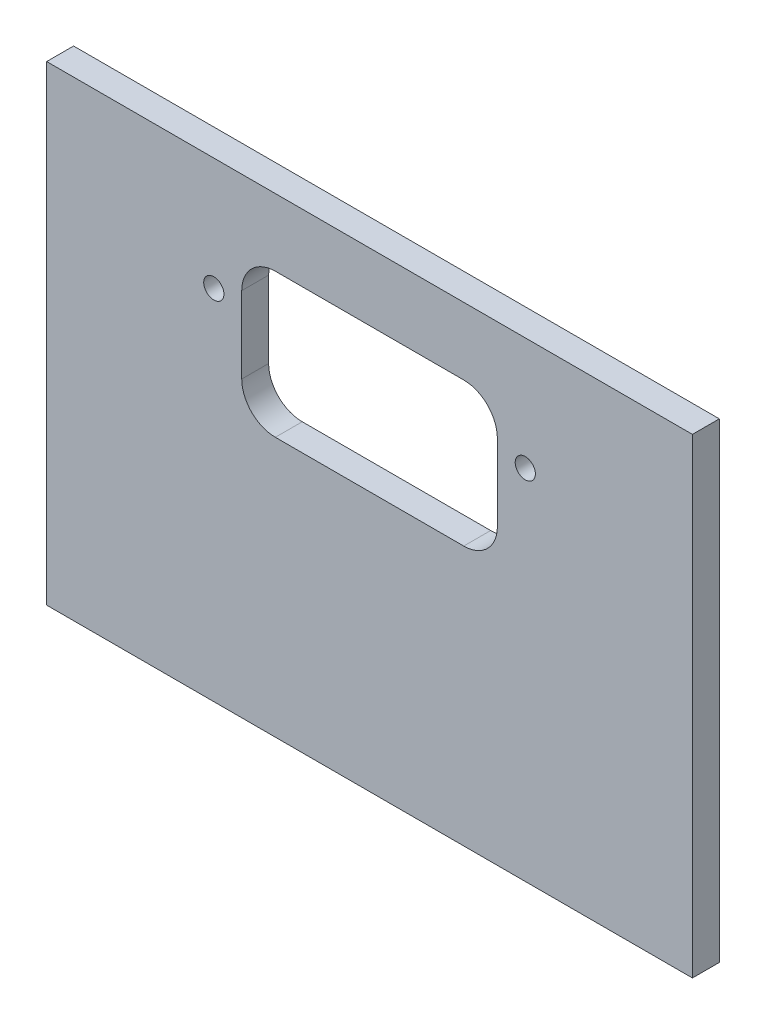
ISO-10303-21;
HEADER;
FILE_DESCRIPTION(('STEP AP214'),'2;1');
FILE_NAME('part.step','',(''),(''),'','','');
FILE_SCHEMA(('AUTOMOTIVE_DESIGN { 1 0 10303 214 1 1 1 1 }'));
ENDSEC;
DATA;
#1=APPLICATION_CONTEXT('core data for automotive mechanical design processes');
#2=APPLICATION_PROTOCOL_DEFINITION('international standard','automotive_design',2000,#1);
#3=PRODUCT_CONTEXT('',#1,'mechanical');
#4=PRODUCT('Part','Part','',(#3));
#5=PRODUCT_RELATED_PRODUCT_CATEGORY('part','',(#4));
#6=PRODUCT_DEFINITION_FORMATION('','',#4);
#7=PRODUCT_DEFINITION_CONTEXT('part definition',#1,'design');
#8=PRODUCT_DEFINITION('design','',#6,#7);
#9=PRODUCT_DEFINITION_SHAPE('','',#8);
#10=(LENGTH_UNIT() NAMED_UNIT(*) SI_UNIT(.MILLI.,.METRE.));
#11=(NAMED_UNIT(*) PLANE_ANGLE_UNIT() SI_UNIT($,.RADIAN.));
#12=(NAMED_UNIT(*) SI_UNIT($,.STERADIAN.) SOLID_ANGLE_UNIT());
#13=UNCERTAINTY_MEASURE_WITH_UNIT(LENGTH_MEASURE(1.E-05),#10,'distance_accuracy_value','');
#14=(GEOMETRIC_REPRESENTATION_CONTEXT(3) GLOBAL_UNCERTAINTY_ASSIGNED_CONTEXT((#13)) GLOBAL_UNIT_ASSIGNED_CONTEXT((#10,
#11,#12)) REPRESENTATION_CONTEXT('',''));
#15=CARTESIAN_POINT('',(0.,0.,0.));
#16=DIRECTION('',(0.,0.,1.));
#17=DIRECTION('',(1.,0.,0.));
#18=AXIS2_PLACEMENT_3D('',#15,#16,#17);
#19=CARTESIAN_POINT('',(0.,0.,4.));
#20=DIRECTION('',(1.,0.,0.));
#21=DIRECTION('',(0.,0.,-1.));
#22=AXIS2_PLACEMENT_3D('',#19,#20,#21);
#23=PLANE('',#22);
#24=DIRECTION('',(0.,-1.,0.));
#25=VECTOR('',#24,1.);
#26=CARTESIAN_POINT('',(0.,0.,0.));
#27=LINE('',#26,#25);
#28=CARTESIAN_POINT('',(0.,0.,0.));
#29=VERTEX_POINT('',#28);
#30=CARTESIAN_POINT('',(0.,-70.,0.));
#31=VERTEX_POINT('',#30);
#32=EDGE_CURVE('E148',#29,#31,#27,.T.);
#33=ORIENTED_EDGE('',*,*,#32,.T.);
#34=DIRECTION('',(0.,0.,-1.));
#35=VECTOR('',#34,1.);
#36=CARTESIAN_POINT('',(0.,-70.,4.));
#37=LINE('',#36,#35);
#38=CARTESIAN_POINT('',(0.,-70.,4.));
#39=VERTEX_POINT('',#38);
#40=EDGE_CURVE('E129',#39,#31,#37,.T.);
#41=ORIENTED_EDGE('',*,*,#40,.F.);
#42=DIRECTION('',(0.,-1.,0.));
#43=VECTOR('',#42,1.);
#44=CARTESIAN_POINT('',(0.,0.,4.));
#45=LINE('',#44,#43);
#46=CARTESIAN_POINT('',(0.,0.,4.));
#47=VERTEX_POINT('',#46);
#48=EDGE_CURVE('E136',#47,#39,#45,.T.);
#49=ORIENTED_EDGE('',*,*,#48,.F.);
#50=DIRECTION('',(0.,0.,-1.));
#51=VECTOR('',#50,1.);
#52=CARTESIAN_POINT('',(0.,0.,4.));
#53=LINE('',#52,#51);
#54=EDGE_CURVE('E279',#47,#29,#53,.T.);
#55=ORIENTED_EDGE('',*,*,#54,.T.);
#56=EDGE_LOOP('',(#33,#41,#49,#55));
#57=FACE_BOUND('',#56,.T.);
#58=ADVANCED_FACE('F35',(#57),#23,.F.);
#59=CARTESIAN_POINT('',(0.,-70.,4.));
#60=DIRECTION('',(0.,1.,0.));
#61=DIRECTION('',(0.,0.,1.));
#62=AXIS2_PLACEMENT_3D('',#59,#60,#61);
#63=PLANE('',#62);
#64=CARTESIAN_POINT('',(86.01,-70.,2.));
#65=DIRECTION('',(0.,-1.,0.));
#66=DIRECTION('',(0.,0.,-1.));
#67=AXIS2_PLACEMENT_3D('',#64,#65,#66);
#68=CIRCLE('',#67,1.25);
#69=CARTESIAN_POINT('',(86.01,-70.,0.750000000000002));
#70=VERTEX_POINT('',#69);
#71=EDGE_CURVE('E172',#70,#70,#68,.T.);
#72=ORIENTED_EDGE('',*,*,#71,.F.);
#73=EDGE_LOOP('',(#72));
#74=FACE_BOUND('',#73,.T.);
#75=CARTESIAN_POINT('',(66.01,-70.,2.));
#76=DIRECTION('',(0.,-1.,0.));
#77=DIRECTION('',(0.,0.,-1.));
#78=AXIS2_PLACEMENT_3D('',#75,#76,#77);
#79=CIRCLE('',#78,1.25);
#80=CARTESIAN_POINT('',(66.01,-70.,0.749999999999998));
#81=VERTEX_POINT('',#80);
#82=EDGE_CURVE('E264',#81,#81,#79,.T.);
#83=ORIENTED_EDGE('',*,*,#82,.F.);
#84=EDGE_LOOP('',(#83));
#85=FACE_BOUND('',#84,.T.);
#86=CARTESIAN_POINT('',(30.,-70.,1.99999999999999));
#87=DIRECTION('',(0.,-1.,0.));
#88=DIRECTION('',(0.,0.,-1.));
#89=AXIS2_PLACEMENT_3D('',#86,#87,#88);
#90=CIRCLE('',#89,1.25);
#91=CARTESIAN_POINT('',(30.,-70.,0.74999999999999));
#92=VERTEX_POINT('',#91);
#93=EDGE_CURVE('E258',#92,#92,#90,.T.);
#94=ORIENTED_EDGE('',*,*,#93,.F.);
#95=EDGE_LOOP('',(#94));
#96=FACE_BOUND('',#95,.T.);
#97=CARTESIAN_POINT('',(10.,-70.,1.99999999999999));
#98=DIRECTION('',(0.,-1.,0.));
#99=DIRECTION('',(0.,0.,-1.));
#100=AXIS2_PLACEMENT_3D('',#97,#98,#99);
#101=CIRCLE('',#100,1.25);
#102=CARTESIAN_POINT('',(10.,-70.,0.74999999999999));
#103=VERTEX_POINT('',#102);
#104=EDGE_CURVE('E252',#103,#103,#101,.T.);
#105=ORIENTED_EDGE('',*,*,#104,.F.);
#106=EDGE_LOOP('',(#105));
#107=FACE_BOUND('',#106,.T.);
#108=CARTESIAN_POINT('',(48.005,-70.,1.99999999999999));
#109=DIRECTION('',(0.,-1.,0.));
#110=DIRECTION('',(0.,0.,-1.));
#111=AXIS2_PLACEMENT_3D('',#108,#109,#110);
#112=CIRCLE('',#111,1.25);
#113=CARTESIAN_POINT('',(48.005,-70.,0.74999999999999));
#114=VERTEX_POINT('',#113);
#115=EDGE_CURVE('E251',#114,#114,#112,.T.);
#116=ORIENTED_EDGE('',*,*,#115,.F.);
#117=EDGE_LOOP('',(#116));
#118=FACE_BOUND('',#117,.T.);
#119=DIRECTION('',(1.,0.,0.));
#120=VECTOR('',#119,1.);
#121=CARTESIAN_POINT('',(0.,-70.,0.));
#122=LINE('',#121,#120);
#123=CARTESIAN_POINT('',(96.01,-70.,0.));
#124=VERTEX_POINT('',#123);
#125=EDGE_CURVE('E281',#31,#124,#122,.T.);
#126=ORIENTED_EDGE('',*,*,#125,.T.);
#127=DIRECTION('',(0.,0.,-1.));
#128=VECTOR('',#127,1.);
#129=CARTESIAN_POINT('',(96.01,-70.,4.));
#130=LINE('',#129,#128);
#131=CARTESIAN_POINT('',(96.01,-70.,4.));
#132=VERTEX_POINT('',#131);
#133=EDGE_CURVE('E132',#132,#124,#130,.T.);
#134=ORIENTED_EDGE('',*,*,#133,.F.);
#135=DIRECTION('',(1.,0.,0.));
#136=VECTOR('',#135,1.);
#137=CARTESIAN_POINT('',(0.,-70.,4.));
#138=LINE('',#137,#136);
#139=EDGE_CURVE('E125',#39,#132,#138,.T.);
#140=ORIENTED_EDGE('',*,*,#139,.F.);
#141=ORIENTED_EDGE('',*,*,#40,.T.);
#142=EDGE_LOOP('',(#126,#134,#140,#141));
#143=FACE_BOUND('',#142,.T.);
#144=ADVANCED_FACE('F127',(#74,#85,#96,#107,#118,#143),#63,.F.);
#145=CARTESIAN_POINT('',(96.01,0.,4.));
#146=DIRECTION('',(-1.,0.,0.));
#147=DIRECTION('',(0.,-1.,0.));
#148=AXIS2_PLACEMENT_3D('',#145,#146,#147);
#149=PLANE('',#148);
#150=DIRECTION('',(0.,1.,0.));
#151=VECTOR('',#150,1.);
#152=CARTESIAN_POINT('',(96.01,0.,0.));
#153=LINE('',#152,#151);
#154=CARTESIAN_POINT('',(96.01,0.,0.));
#155=VERTEX_POINT('',#154);
#156=EDGE_CURVE('E283',#124,#155,#153,.T.);
#157=ORIENTED_EDGE('',*,*,#156,.T.);
#158=DIRECTION('',(0.,0.,-1.));
#159=VECTOR('',#158,1.);
#160=CARTESIAN_POINT('',(96.01,0.,4.));
#161=LINE('',#160,#159);
#162=CARTESIAN_POINT('',(96.01,0.,4.));
#163=VERTEX_POINT('',#162);
#164=EDGE_CURVE('E153',#163,#155,#161,.T.);
#165=ORIENTED_EDGE('',*,*,#164,.F.);
#166=DIRECTION('',(0.,1.,0.));
#167=VECTOR('',#166,1.);
#168=CARTESIAN_POINT('',(96.01,0.,4.));
#169=LINE('',#168,#167);
#170=EDGE_CURVE('E135',#132,#163,#169,.T.);
#171=ORIENTED_EDGE('',*,*,#170,.F.);
#172=ORIENTED_EDGE('',*,*,#133,.T.);
#173=EDGE_LOOP('',(#157,#165,#171,#172));
#174=FACE_BOUND('',#173,.T.);
#175=ADVANCED_FACE('F293',(#174),#149,.F.);
#176=CARTESIAN_POINT('',(0.,0.,4.));
#177=DIRECTION('',(0.,-1.,0.));
#178=DIRECTION('',(0.,0.,-1.));
#179=AXIS2_PLACEMENT_3D('',#176,#177,#178);
#180=PLANE('',#179);
#181=DIRECTION('',(-1.,0.,0.));
#182=VECTOR('',#181,1.);
#183=CARTESIAN_POINT('',(0.,0.,0.));
#184=LINE('',#183,#182);
#185=EDGE_CURVE('E145',#155,#29,#184,.T.);
#186=ORIENTED_EDGE('',*,*,#185,.T.);
#187=ORIENTED_EDGE('',*,*,#54,.F.);
#188=DIRECTION('',(-1.,0.,0.));
#189=VECTOR('',#188,1.);
#190=CARTESIAN_POINT('',(0.,0.,4.));
#191=LINE('',#190,#189);
#192=EDGE_CURVE('E141',#163,#47,#191,.T.);
#193=ORIENTED_EDGE('',*,*,#192,.F.);
#194=ORIENTED_EDGE('',*,*,#164,.T.);
#195=EDGE_LOOP('',(#186,#187,#193,#194));
#196=FACE_BOUND('',#195,.T.);
#197=ADVANCED_FACE('F290',(#196),#180,.F.);
#198=CARTESIAN_POINT('',(0.,0.,4.));
#199=DIRECTION('',(0.,0.,1.));
#200=DIRECTION('',(1.,0.,0.));
#201=AXIS2_PLACEMENT_3D('',#198,#199,#200);
#202=PLANE('',#201);
#203=CARTESIAN_POINT('',(71.16,-16.78,4.));
#204=DIRECTION('',(0.,0.,1.));
#205=DIRECTION('',(1.,0.,0.));
#206=AXIS2_PLACEMENT_3D('',#203,#204,#205);
#207=CIRCLE('',#206,1.5);
#208=CARTESIAN_POINT('',(72.66,-16.78,4.));
#209=VERTEX_POINT('',#208);
#210=EDGE_CURVE('E552',#209,#209,#207,.T.);
#211=ORIENTED_EDGE('',*,*,#210,.F.);
#212=EDGE_LOOP('',(#211));
#213=FACE_BOUND('',#212,.T.);
#214=CARTESIAN_POINT('',(24.85,-16.78,4.));
#215=DIRECTION('',(0.,0.,1.));
#216=DIRECTION('',(1.,0.,0.));
#217=AXIS2_PLACEMENT_3D('',#214,#215,#216);
#218=CIRCLE('',#217,1.5);
#219=CARTESIAN_POINT('',(26.35,-16.78,4.));
#220=VERTEX_POINT('',#219);
#221=EDGE_CURVE('E243',#220,#220,#218,.T.);
#222=ORIENTED_EDGE('',*,*,#221,.F.);
#223=EDGE_LOOP('',(#222));
#224=FACE_BOUND('',#223,.T.);
#225=DIRECTION('',(0.,-1.,0.));
#226=VECTOR('',#225,1.);
#227=CARTESIAN_POINT('',(29.,-10.,4.));
#228=LINE('',#227,#226);
#229=CARTESIAN_POINT('',(29.,-15.,4.));
#230=VERTEX_POINT('',#229);
#231=CARTESIAN_POINT('',(29.,-26.3819711470993,4.));
#232=VERTEX_POINT('',#231);
#233=EDGE_CURVE('E230',#230,#232,#228,.T.);
#234=ORIENTED_EDGE('',*,*,#233,.F.);
#235=CARTESIAN_POINT('',(34.,-15.,4.));
#236=DIRECTION('',(0.,0.,1.));
#237=DIRECTION('',(1.,0.,0.));
#238=AXIS2_PLACEMENT_3D('',#235,#236,#237);
#239=CIRCLE('',#238,5.);
#240=CARTESIAN_POINT('',(34.,-10.,4.));
#241=VERTEX_POINT('',#240);
#242=EDGE_CURVE('E195',#230,#241,#239,.F.);
#243=ORIENTED_EDGE('',*,*,#242,.T.);
#244=DIRECTION('',(-1.,0.,0.));
#245=VECTOR('',#244,1.);
#246=CARTESIAN_POINT('',(29.,-10.,4.));
#247=LINE('',#246,#245);
#248=CARTESIAN_POINT('',(62.01,-10.,4.));
#249=VERTEX_POINT('',#248);
#250=EDGE_CURVE('E169',#249,#241,#247,.T.);
#251=ORIENTED_EDGE('',*,*,#250,.F.);
#252=CARTESIAN_POINT('',(62.01,-15.,4.));
#253=DIRECTION('',(0.,0.,1.));
#254=DIRECTION('',(1.,0.,0.));
#255=AXIS2_PLACEMENT_3D('',#252,#253,#254);
#256=CIRCLE('',#255,5.);
#257=CARTESIAN_POINT('',(67.01,-15.,4.));
#258=VERTEX_POINT('',#257);
#259=EDGE_CURVE('E43',#249,#258,#256,.F.);
#260=ORIENTED_EDGE('',*,*,#259,.T.);
#261=DIRECTION('',(0.,1.,0.));
#262=VECTOR('',#261,1.);
#263=CARTESIAN_POINT('',(67.01,-10.,4.));
#264=LINE('',#263,#262);
#265=CARTESIAN_POINT('',(67.01,-26.3819711470993,4.));
#266=VERTEX_POINT('',#265);
#267=EDGE_CURVE('E205',#266,#258,#264,.T.);
#268=ORIENTED_EDGE('',*,*,#267,.F.);
#269=CARTESIAN_POINT('',(62.01,-26.3819711470993,4.));
#270=DIRECTION('',(0.,0.,1.));
#271=DIRECTION('',(1.,0.,0.));
#272=AXIS2_PLACEMENT_3D('',#269,#270,#271);
#273=CIRCLE('',#272,5.);
#274=CARTESIAN_POINT('',(62.01,-31.3819711470993,4.));
#275=VERTEX_POINT('',#274);
#276=EDGE_CURVE('E199',#266,#275,#273,.F.);
#277=ORIENTED_EDGE('',*,*,#276,.T.);
#278=DIRECTION('',(1.,0.,0.));
#279=VECTOR('',#278,1.);
#280=CARTESIAN_POINT('',(29.,-31.3819711470993,4.));
#281=LINE('',#280,#279);
#282=CARTESIAN_POINT('',(34.,-31.3819711470993,4.));
#283=VERTEX_POINT('',#282);
#284=EDGE_CURVE('E211',#283,#275,#281,.T.);
#285=ORIENTED_EDGE('',*,*,#284,.F.);
#286=CARTESIAN_POINT('',(34.,-26.3819711470993,4.));
#287=DIRECTION('',(0.,0.,1.));
#288=DIRECTION('',(1.,0.,0.));
#289=AXIS2_PLACEMENT_3D('',#286,#287,#288);
#290=CIRCLE('',#289,5.);
#291=EDGE_CURVE('E191',#283,#232,#290,.F.);
#292=ORIENTED_EDGE('',*,*,#291,.T.);
#293=EDGE_LOOP('',(#234,#243,#251,#260,#268,#277,#285,#292));
#294=FACE_BOUND('',#293,.T.);
#295=ORIENTED_EDGE('',*,*,#48,.T.);
#296=ORIENTED_EDGE('',*,*,#139,.T.);
#297=ORIENTED_EDGE('',*,*,#170,.T.);
#298=ORIENTED_EDGE('',*,*,#192,.T.);
#299=EDGE_LOOP('',(#295,#296,#297,#298));
#300=FACE_BOUND('',#299,.T.);
#301=ADVANCED_FACE('F139',(#213,#224,#294,#300),#202,.T.);
#302=CARTESIAN_POINT('',(0.,0.,0.));
#303=DIRECTION('',(0.,0.,1.));
#304=DIRECTION('',(1.,0.,0.));
#305=AXIS2_PLACEMENT_3D('',#302,#303,#304);
#306=PLANE('',#305);
#307=CARTESIAN_POINT('',(71.16,-16.78,0.));
#308=DIRECTION('',(0.,0.,1.));
#309=DIRECTION('',(1.,0.,0.));
#310=AXIS2_PLACEMENT_3D('',#307,#308,#309);
#311=CIRCLE('',#310,1.5);
#312=CARTESIAN_POINT('',(72.66,-16.78,0.));
#313=VERTEX_POINT('',#312);
#314=EDGE_CURVE('E168',#313,#313,#311,.T.);
#315=ORIENTED_EDGE('',*,*,#314,.T.);
#316=EDGE_LOOP('',(#315));
#317=FACE_BOUND('',#316,.T.);
#318=CARTESIAN_POINT('',(24.85,-16.78,0.));
#319=DIRECTION('',(0.,0.,1.));
#320=DIRECTION('',(1.,0.,0.));
#321=AXIS2_PLACEMENT_3D('',#318,#319,#320);
#322=CIRCLE('',#321,1.5);
#323=CARTESIAN_POINT('',(26.35,-16.78,0.));
#324=VERTEX_POINT('',#323);
#325=EDGE_CURVE('E165',#324,#324,#322,.T.);
#326=ORIENTED_EDGE('',*,*,#325,.T.);
#327=EDGE_LOOP('',(#326));
#328=FACE_BOUND('',#327,.T.);
#329=DIRECTION('',(0.,1.,0.));
#330=VECTOR('',#329,1.);
#331=CARTESIAN_POINT('',(67.01,0.,0.));
#332=LINE('',#331,#330);
#333=CARTESIAN_POINT('',(67.01,-26.3819711470993,0.));
#334=VERTEX_POINT('',#333);
#335=CARTESIAN_POINT('',(67.01,-15.,0.));
#336=VERTEX_POINT('',#335);
#337=EDGE_CURVE('E151',#334,#336,#332,.T.);
#338=ORIENTED_EDGE('',*,*,#337,.T.);
#339=CARTESIAN_POINT('',(62.01,-15.,0.));
#340=DIRECTION('',(0.,0.,1.));
#341=DIRECTION('',(1.,0.,0.));
#342=AXIS2_PLACEMENT_3D('',#339,#340,#341);
#343=CIRCLE('',#342,5.);
#344=CARTESIAN_POINT('',(62.01,-10.,0.));
#345=VERTEX_POINT('',#344);
#346=EDGE_CURVE('E11',#336,#345,#343,.T.);
#347=ORIENTED_EDGE('',*,*,#346,.T.);
#348=DIRECTION('',(-1.,0.,0.));
#349=VECTOR('',#348,1.);
#350=CARTESIAN_POINT('',(0.,-10.,0.));
#351=LINE('',#350,#349);
#352=CARTESIAN_POINT('',(34.,-10.,0.));
#353=VERTEX_POINT('',#352);
#354=EDGE_CURVE('E158',#345,#353,#351,.T.);
#355=ORIENTED_EDGE('',*,*,#354,.T.);
#356=CARTESIAN_POINT('',(34.,-15.,0.));
#357=DIRECTION('',(0.,0.,1.));
#358=DIRECTION('',(1.,0.,0.));
#359=AXIS2_PLACEMENT_3D('',#356,#357,#358);
#360=CIRCLE('',#359,5.);
#361=CARTESIAN_POINT('',(29.,-15.,0.));
#362=VERTEX_POINT('',#361);
#363=EDGE_CURVE('E197',#353,#362,#360,.T.);
#364=ORIENTED_EDGE('',*,*,#363,.T.);
#365=DIRECTION('',(0.,-1.,0.));
#366=VECTOR('',#365,1.);
#367=CARTESIAN_POINT('',(29.,0.,0.));
#368=LINE('',#367,#366);
#369=CARTESIAN_POINT('',(29.,-26.3819711470993,0.));
#370=VERTEX_POINT('',#369);
#371=EDGE_CURVE('E161',#362,#370,#368,.T.);
#372=ORIENTED_EDGE('',*,*,#371,.T.);
#373=CARTESIAN_POINT('',(34.,-26.3819711470993,0.));
#374=DIRECTION('',(0.,0.,1.));
#375=DIRECTION('',(1.,0.,0.));
#376=AXIS2_PLACEMENT_3D('',#373,#374,#375);
#377=CIRCLE('',#376,5.);
#378=CARTESIAN_POINT('',(34.,-31.3819711470993,0.));
#379=VERTEX_POINT('',#378);
#380=EDGE_CURVE('E193',#370,#379,#377,.T.);
#381=ORIENTED_EDGE('',*,*,#380,.T.);
#382=DIRECTION('',(1.,0.,0.));
#383=VECTOR('',#382,1.);
#384=CARTESIAN_POINT('',(0.,-31.3819711470993,0.));
#385=LINE('',#384,#383);
#386=CARTESIAN_POINT('',(62.01,-31.3819711470993,0.));
#387=VERTEX_POINT('',#386);
#388=EDGE_CURVE('E149',#379,#387,#385,.T.);
#389=ORIENTED_EDGE('',*,*,#388,.T.);
#390=CARTESIAN_POINT('',(62.01,-26.3819711470993,0.));
#391=DIRECTION('',(0.,0.,1.));
#392=DIRECTION('',(1.,0.,0.));
#393=AXIS2_PLACEMENT_3D('',#390,#391,#392);
#394=CIRCLE('',#393,5.);
#395=EDGE_CURVE('E57',#387,#334,#394,.T.);
#396=ORIENTED_EDGE('',*,*,#395,.T.);
#397=EDGE_LOOP('',(#338,#347,#355,#364,#372,#381,#389,#396));
#398=FACE_BOUND('',#397,.T.);
#399=ORIENTED_EDGE('',*,*,#32,.F.);
#400=ORIENTED_EDGE('',*,*,#185,.F.);
#401=ORIENTED_EDGE('',*,*,#156,.F.);
#402=ORIENTED_EDGE('',*,*,#125,.F.);
#403=EDGE_LOOP('',(#399,#400,#401,#402));
#404=FACE_BOUND('',#403,.T.);
#405=ADVANCED_FACE('F215',(#317,#328,#398,#404),#306,.F.);
#406=CARTESIAN_POINT('',(48.005,-58.,1.99999999999999));
#407=DIRECTION('',(0.,-1.,0.));
#408=DIRECTION('',(0.,0.,-1.));
#409=AXIS2_PLACEMENT_3D('',#406,#407,#408);
#410=CYLINDRICAL_SURFACE('',#409,1.25);
#411=CARTESIAN_POINT('',(48.005,-58.,1.99999999999999));
#412=DIRECTION('',(0.,-1.,0.));
#413=DIRECTION('',(0.,0.,-1.));
#414=AXIS2_PLACEMENT_3D('',#411,#412,#413);
#415=CIRCLE('',#414,1.25);
#416=CARTESIAN_POINT('',(48.005,-58.,0.74999999999999));
#417=VERTEX_POINT('',#416);
#418=EDGE_CURVE('E272',#417,#417,#415,.T.);
#419=ORIENTED_EDGE('',*,*,#418,.F.);
#420=EDGE_LOOP('',(#419));
#421=FACE_BOUND('',#420,.T.);
#422=ORIENTED_EDGE('',*,*,#115,.T.);
#423=EDGE_LOOP('',(#422));
#424=FACE_BOUND('',#423,.T.);
#425=ADVANCED_FACE('F383',(#421,#424),#410,.F.);
#426=CARTESIAN_POINT('',(48.005,-58.,1.99999999999999));
#427=DIRECTION('',(0.,-1.,0.));
#428=DIRECTION('',(0.,0.,-1.));
#429=AXIS2_PLACEMENT_3D('',#426,#427,#428);
#430=PLANE('',#429);
#431=ORIENTED_EDGE('',*,*,#418,.T.);
#432=EDGE_LOOP('',(#431));
#433=FACE_BOUND('',#432,.T.);
#434=ADVANCED_FACE('F487',(#433),#430,.T.);
#435=CARTESIAN_POINT('',(10.,-58.,1.99999999999999));
#436=DIRECTION('',(0.,-1.,0.));
#437=DIRECTION('',(0.,0.,-1.));
#438=AXIS2_PLACEMENT_3D('',#435,#436,#437);
#439=CYLINDRICAL_SURFACE('',#438,1.25);
#440=CARTESIAN_POINT('',(10.,-58.,1.99999999999999));
#441=DIRECTION('',(0.,-1.,0.));
#442=DIRECTION('',(0.,0.,-1.));
#443=AXIS2_PLACEMENT_3D('',#440,#441,#442);
#444=CIRCLE('',#443,1.25);
#445=CARTESIAN_POINT('',(10.,-58.,0.74999999999999));
#446=VERTEX_POINT('',#445);
#447=EDGE_CURVE('E248',#446,#446,#444,.T.);
#448=ORIENTED_EDGE('',*,*,#447,.F.);
#449=EDGE_LOOP('',(#448));
#450=FACE_BOUND('',#449,.T.);
#451=ORIENTED_EDGE('',*,*,#104,.T.);
#452=EDGE_LOOP('',(#451));
#453=FACE_BOUND('',#452,.T.);
#454=ADVANCED_FACE('F477',(#450,#453),#439,.F.);
#455=CARTESIAN_POINT('',(10.,-58.,1.99999999999999));
#456=DIRECTION('',(0.,-1.,0.));
#457=DIRECTION('',(0.,0.,-1.));
#458=AXIS2_PLACEMENT_3D('',#455,#456,#457);
#459=PLANE('',#458);
#460=ORIENTED_EDGE('',*,*,#447,.T.);
#461=EDGE_LOOP('',(#460));
#462=FACE_BOUND('',#461,.T.);
#463=ADVANCED_FACE('F467',(#462),#459,.T.);
#464=CARTESIAN_POINT('',(30.,-58.,1.99999999999999));
#465=DIRECTION('',(0.,-1.,0.));
#466=DIRECTION('',(0.,0.,-1.));
#467=AXIS2_PLACEMENT_3D('',#464,#465,#466);
#468=CYLINDRICAL_SURFACE('',#467,1.25);
#469=CARTESIAN_POINT('',(30.,-58.,1.99999999999999));
#470=DIRECTION('',(0.,-1.,0.));
#471=DIRECTION('',(0.,0.,-1.));
#472=AXIS2_PLACEMENT_3D('',#469,#470,#471);
#473=CIRCLE('',#472,1.25);
#474=CARTESIAN_POINT('',(30.,-58.,0.74999999999999));
#475=VERTEX_POINT('',#474);
#476=EDGE_CURVE('E255',#475,#475,#473,.T.);
#477=ORIENTED_EDGE('',*,*,#476,.F.);
#478=EDGE_LOOP('',(#477));
#479=FACE_BOUND('',#478,.T.);
#480=ORIENTED_EDGE('',*,*,#93,.T.);
#481=EDGE_LOOP('',(#480));
#482=FACE_BOUND('',#481,.T.);
#483=ADVANCED_FACE('F457',(#479,#482),#468,.F.);
#484=CARTESIAN_POINT('',(30.,-58.,1.99999999999999));
#485=DIRECTION('',(0.,-1.,0.));
#486=DIRECTION('',(0.,0.,-1.));
#487=AXIS2_PLACEMENT_3D('',#484,#485,#486);
#488=PLANE('',#487);
#489=ORIENTED_EDGE('',*,*,#476,.T.);
#490=EDGE_LOOP('',(#489));
#491=FACE_BOUND('',#490,.T.);
#492=ADVANCED_FACE('F447',(#491),#488,.T.);
#493=CARTESIAN_POINT('',(66.01,-58.,2.));
#494=DIRECTION('',(0.,-1.,0.));
#495=DIRECTION('',(0.,0.,-1.));
#496=AXIS2_PLACEMENT_3D('',#493,#494,#495);
#497=CYLINDRICAL_SURFACE('',#496,1.25);
#498=CARTESIAN_POINT('',(66.01,-58.,2.));
#499=DIRECTION('',(0.,-1.,0.));
#500=DIRECTION('',(0.,0.,-1.));
#501=AXIS2_PLACEMENT_3D('',#498,#499,#500);
#502=CIRCLE('',#501,1.25);
#503=CARTESIAN_POINT('',(66.01,-58.,0.749999999999998));
#504=VERTEX_POINT('',#503);
#505=EDGE_CURVE('E261',#504,#504,#502,.T.);
#506=ORIENTED_EDGE('',*,*,#505,.F.);
#507=EDGE_LOOP('',(#506));
#508=FACE_BOUND('',#507,.T.);
#509=ORIENTED_EDGE('',*,*,#82,.T.);
#510=EDGE_LOOP('',(#509));
#511=FACE_BOUND('',#510,.T.);
#512=ADVANCED_FACE('F437',(#508,#511),#497,.F.);
#513=CARTESIAN_POINT('',(66.01,-58.,2.));
#514=DIRECTION('',(0.,-1.,0.));
#515=DIRECTION('',(0.,0.,-1.));
#516=AXIS2_PLACEMENT_3D('',#513,#514,#515);
#517=PLANE('',#516);
#518=ORIENTED_EDGE('',*,*,#505,.T.);
#519=EDGE_LOOP('',(#518));
#520=FACE_BOUND('',#519,.T.);
#521=ADVANCED_FACE('F427',(#520),#517,.T.);
#522=CARTESIAN_POINT('',(86.01,-58.,2.));
#523=DIRECTION('',(0.,-1.,0.));
#524=DIRECTION('',(0.,0.,-1.));
#525=AXIS2_PLACEMENT_3D('',#522,#523,#524);
#526=CYLINDRICAL_SURFACE('',#525,1.25);
#527=CARTESIAN_POINT('',(86.01,-58.,2.));
#528=DIRECTION('',(0.,-1.,0.));
#529=DIRECTION('',(0.,0.,-1.));
#530=AXIS2_PLACEMENT_3D('',#527,#528,#529);
#531=CIRCLE('',#530,1.25);
#532=CARTESIAN_POINT('',(86.01,-58.,0.750000000000002));
#533=VERTEX_POINT('',#532);
#534=EDGE_CURVE('E267',#533,#533,#531,.T.);
#535=ORIENTED_EDGE('',*,*,#534,.F.);
#536=EDGE_LOOP('',(#535));
#537=FACE_BOUND('',#536,.T.);
#538=ORIENTED_EDGE('',*,*,#71,.T.);
#539=EDGE_LOOP('',(#538));
#540=FACE_BOUND('',#539,.T.);
#541=ADVANCED_FACE('F417',(#537,#540),#526,.F.);
#542=CARTESIAN_POINT('',(86.01,-58.,2.));
#543=DIRECTION('',(0.,-1.,0.));
#544=DIRECTION('',(0.,0.,-1.));
#545=AXIS2_PLACEMENT_3D('',#542,#543,#544);
#546=PLANE('',#545);
#547=ORIENTED_EDGE('',*,*,#534,.T.);
#548=EDGE_LOOP('',(#547));
#549=FACE_BOUND('',#548,.T.);
#550=ADVANCED_FACE('F372',(#549),#546,.T.);
#551=CARTESIAN_POINT('',(29.,-10.,-6.));
#552=DIRECTION('',(-1.,0.,0.));
#553=DIRECTION('',(0.,0.,1.));
#554=AXIS2_PLACEMENT_3D('',#551,#552,#553);
#555=PLANE('',#554);
#556=ORIENTED_EDGE('',*,*,#233,.T.);
#557=DIRECTION('',(0.,0.,1.));
#558=VECTOR('',#557,1.);
#559=CARTESIAN_POINT('',(29.,-26.3819711470993,0.));
#560=LINE('',#559,#558);
#561=EDGE_CURVE('E180',#232,#370,#560,.F.);
#562=ORIENTED_EDGE('',*,*,#561,.T.);
#563=ORIENTED_EDGE('',*,*,#371,.F.);
#564=DIRECTION('',(0.,0.,1.));
#565=VECTOR('',#564,1.);
#566=CARTESIAN_POINT('',(29.,-15.,4.));
#567=LINE('',#566,#565);
#568=EDGE_CURVE('E177',#362,#230,#567,.T.);
#569=ORIENTED_EDGE('',*,*,#568,.T.);
#570=EDGE_LOOP('',(#556,#562,#563,#569));
#571=FACE_BOUND('',#570,.T.);
#572=ADVANCED_FACE('F228',(#571),#555,.F.);
#573=CARTESIAN_POINT('',(29.,-10.,-6.));
#574=DIRECTION('',(0.,1.,0.));
#575=DIRECTION('',(0.,0.,1.));
#576=AXIS2_PLACEMENT_3D('',#573,#574,#575);
#577=PLANE('',#576);
#578=ORIENTED_EDGE('',*,*,#250,.T.);
#579=DIRECTION('',(0.,0.,1.));
#580=VECTOR('',#579,1.);
#581=CARTESIAN_POINT('',(34.,-10.,0.));
#582=LINE('',#581,#580);
#583=EDGE_CURVE('E185',#241,#353,#582,.F.);
#584=ORIENTED_EDGE('',*,*,#583,.T.);
#585=ORIENTED_EDGE('',*,*,#354,.F.);
#586=DIRECTION('',(0.,0.,1.));
#587=VECTOR('',#586,1.);
#588=CARTESIAN_POINT('',(62.01,-10.,4.));
#589=LINE('',#588,#587);
#590=EDGE_CURVE('E182',#345,#249,#589,.T.);
#591=ORIENTED_EDGE('',*,*,#590,.T.);
#592=EDGE_LOOP('',(#578,#584,#585,#591));
#593=FACE_BOUND('',#592,.T.);
#594=ADVANCED_FACE('F219',(#593),#577,.F.);
#595=CARTESIAN_POINT('',(67.01,-10.,-6.));
#596=DIRECTION('',(1.,0.,0.));
#597=DIRECTION('',(0.,0.,-1.));
#598=AXIS2_PLACEMENT_3D('',#595,#596,#597);
#599=PLANE('',#598);
#600=ORIENTED_EDGE('',*,*,#337,.F.);
#601=DIRECTION('',(0.,0.,1.));
#602=VECTOR('',#601,1.);
#603=CARTESIAN_POINT('',(67.01,-26.3819711470993,4.));
#604=LINE('',#603,#602);
#605=EDGE_CURVE('E188',#334,#266,#604,.T.);
#606=ORIENTED_EDGE('',*,*,#605,.T.);
#607=ORIENTED_EDGE('',*,*,#267,.T.);
#608=DIRECTION('',(0.,0.,1.));
#609=VECTOR('',#608,1.);
#610=CARTESIAN_POINT('',(67.01,-15.,0.));
#611=LINE('',#610,#609);
#612=EDGE_CURVE('E50',#258,#336,#611,.F.);
#613=ORIENTED_EDGE('',*,*,#612,.T.);
#614=EDGE_LOOP('',(#600,#606,#607,#613));
#615=FACE_BOUND('',#614,.T.);
#616=ADVANCED_FACE('F209',(#615),#599,.F.);
#617=CARTESIAN_POINT('',(29.,-31.3819711470993,-6.));
#618=DIRECTION('',(0.,-1.,0.));
#619=DIRECTION('',(0.,0.,-1.));
#620=AXIS2_PLACEMENT_3D('',#617,#618,#619);
#621=PLANE('',#620);
#622=ORIENTED_EDGE('',*,*,#388,.F.);
#623=DIRECTION('',(0.,0.,1.));
#624=VECTOR('',#623,1.);
#625=CARTESIAN_POINT('',(34.,-31.3819711470993,4.));
#626=LINE('',#625,#624);
#627=EDGE_CURVE('E174',#379,#283,#626,.T.);
#628=ORIENTED_EDGE('',*,*,#627,.T.);
#629=ORIENTED_EDGE('',*,*,#284,.T.);
#630=DIRECTION('',(0.,0.,1.));
#631=VECTOR('',#630,1.);
#632=CARTESIAN_POINT('',(62.01,-31.3819711470993,0.));
#633=LINE('',#632,#631);
#634=EDGE_CURVE('E164',#275,#387,#633,.F.);
#635=ORIENTED_EDGE('',*,*,#634,.T.);
#636=EDGE_LOOP('',(#622,#628,#629,#635));
#637=FACE_BOUND('',#636,.T.);
#638=ADVANCED_FACE('F236',(#637),#621,.F.);
#639=CARTESIAN_POINT('',(24.85,-16.78,-6.));
#640=DIRECTION('',(0.,0.,1.));
#641=DIRECTION('',(1.,0.,0.));
#642=AXIS2_PLACEMENT_3D('',#639,#640,#641);
#643=CYLINDRICAL_SURFACE('',#642,1.5);
#644=ORIENTED_EDGE('',*,*,#221,.T.);
#645=EDGE_LOOP('',(#644));
#646=FACE_BOUND('',#645,.T.);
#647=ORIENTED_EDGE('',*,*,#325,.F.);
#648=EDGE_LOOP('',(#647));
#649=FACE_BOUND('',#648,.T.);
#650=ADVANCED_FACE('F345',(#646,#649),#643,.F.);
#651=CARTESIAN_POINT('',(71.16,-16.78,-6.));
#652=DIRECTION('',(0.,0.,1.));
#653=DIRECTION('',(1.,0.,0.));
#654=AXIS2_PLACEMENT_3D('',#651,#652,#653);
#655=CYLINDRICAL_SURFACE('',#654,1.5);
#656=ORIENTED_EDGE('',*,*,#210,.T.);
#657=EDGE_LOOP('',(#656));
#658=FACE_BOUND('',#657,.T.);
#659=ORIENTED_EDGE('',*,*,#314,.F.);
#660=EDGE_LOOP('',(#659));
#661=FACE_BOUND('',#660,.T.);
#662=ADVANCED_FACE('F310',(#658,#661),#655,.F.);
#663=CARTESIAN_POINT('',(34.,-26.3819711470993,-6.));
#664=DIRECTION('',(0.,0.,-1.));
#665=DIRECTION('',(-1.,0.,0.));
#666=AXIS2_PLACEMENT_3D('',#663,#664,#665);
#667=CYLINDRICAL_SURFACE('',#666,5.);
#668=ORIENTED_EDGE('',*,*,#380,.F.);
#669=ORIENTED_EDGE('',*,*,#561,.F.);
#670=ORIENTED_EDGE('',*,*,#291,.F.);
#671=ORIENTED_EDGE('',*,*,#627,.F.);
#672=EDGE_LOOP('',(#668,#669,#670,#671));
#673=FACE_BOUND('',#672,.T.);
#674=ADVANCED_FACE('F232',(#673),#667,.F.);
#675=CARTESIAN_POINT('',(34.,-15.,-6.));
#676=DIRECTION('',(0.,0.,-1.));
#677=DIRECTION('',(-1.,0.,0.));
#678=AXIS2_PLACEMENT_3D('',#675,#676,#677);
#679=CYLINDRICAL_SURFACE('',#678,5.);
#680=ORIENTED_EDGE('',*,*,#363,.F.);
#681=ORIENTED_EDGE('',*,*,#583,.F.);
#682=ORIENTED_EDGE('',*,*,#242,.F.);
#683=ORIENTED_EDGE('',*,*,#568,.F.);
#684=EDGE_LOOP('',(#680,#681,#682,#683));
#685=FACE_BOUND('',#684,.T.);
#686=ADVANCED_FACE('F222',(#685),#679,.F.);
#687=CARTESIAN_POINT('',(62.01,-26.3819711470993,-6.));
#688=DIRECTION('',(0.,0.,-1.));
#689=DIRECTION('',(-1.,0.,0.));
#690=AXIS2_PLACEMENT_3D('',#687,#688,#689);
#691=CYLINDRICAL_SURFACE('',#690,5.);
#692=ORIENTED_EDGE('',*,*,#395,.F.);
#693=ORIENTED_EDGE('',*,*,#634,.F.);
#694=ORIENTED_EDGE('',*,*,#276,.F.);
#695=ORIENTED_EDGE('',*,*,#605,.F.);
#696=EDGE_LOOP('',(#692,#693,#694,#695));
#697=FACE_BOUND('',#696,.T.);
#698=ADVANCED_FACE('F241',(#697),#691,.F.);
#699=CARTESIAN_POINT('',(62.01,-15.,-6.));
#700=DIRECTION('',(0.,0.,-1.));
#701=DIRECTION('',(-1.,0.,0.));
#702=AXIS2_PLACEMENT_3D('',#699,#700,#701);
#703=CYLINDRICAL_SURFACE('',#702,5.);
#704=ORIENTED_EDGE('',*,*,#346,.F.);
#705=ORIENTED_EDGE('',*,*,#612,.F.);
#706=ORIENTED_EDGE('',*,*,#259,.F.);
#707=ORIENTED_EDGE('',*,*,#590,.F.);
#708=EDGE_LOOP('',(#704,#705,#706,#707));
#709=FACE_BOUND('',#708,.T.);
#710=ADVANCED_FACE('F37',(#709),#703,.F.);
#711=CLOSED_SHELL('',(#58,#144,#175,#197,#301,#405,#425,#434,#454,#463,#483,#492,#512,#521,#541,
#550,#572,#594,#616,#638,#650,#662,#674,#686,#698,#710));
#712=MANIFOLD_SOLID_BREP('B2',#711);
#713=ADVANCED_BREP_SHAPE_REPRESENTATION('',(#18,#712),#14);
#714=SHAPE_DEFINITION_REPRESENTATION(#9,#713);
ENDSEC;
END-ISO-10303-21;
